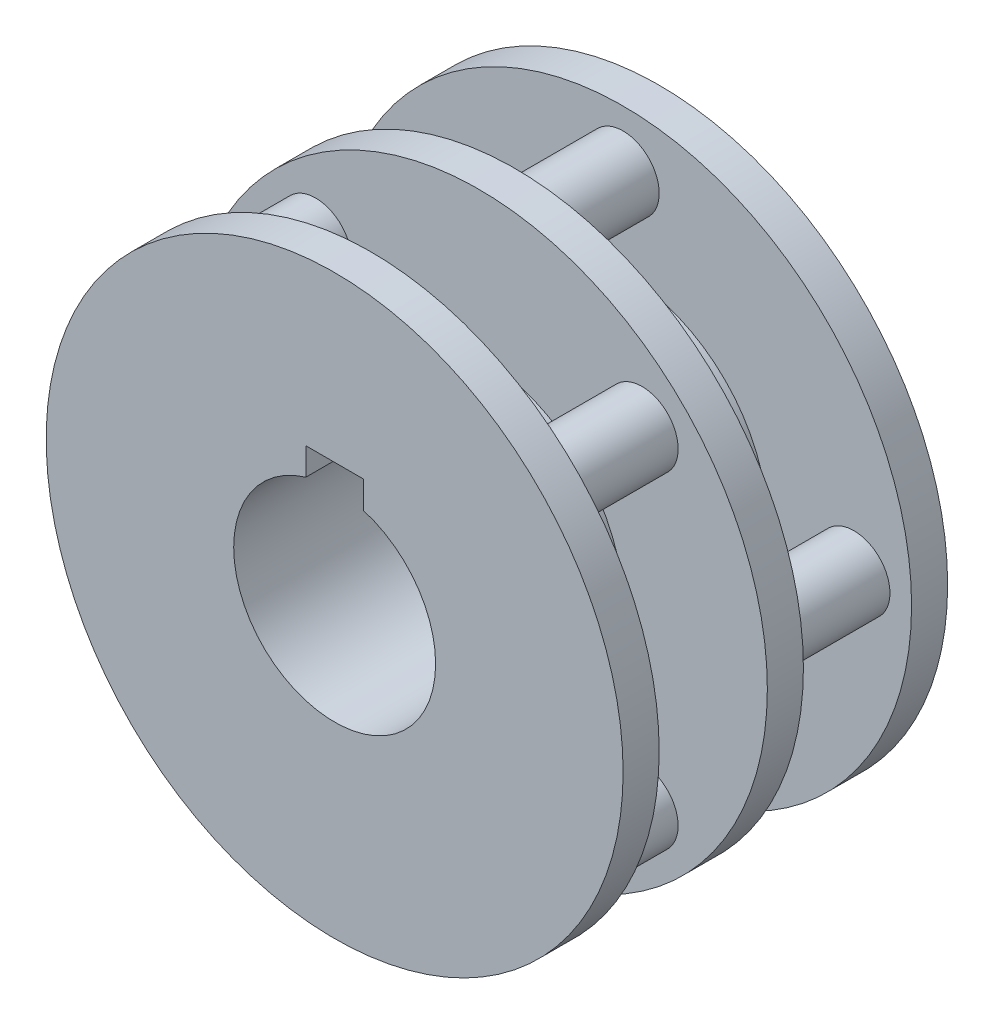
ISO-10303-21;
HEADER;
FILE_DESCRIPTION(('STEP AP214'),'2;1');
FILE_NAME('part.step','',(''),(''),'','','');
FILE_SCHEMA(('AUTOMOTIVE_DESIGN { 1 0 10303 214 1 1 1 1 }'));
ENDSEC;
DATA;
#1=APPLICATION_CONTEXT('core data for automotive mechanical design processes');
#2=APPLICATION_PROTOCOL_DEFINITION('international standard','automotive_design',2000,#1);
#3=PRODUCT_CONTEXT('',#1,'mechanical');
#4=PRODUCT('Part','Part','',(#3));
#5=PRODUCT_RELATED_PRODUCT_CATEGORY('part','',(#4));
#6=PRODUCT_DEFINITION_FORMATION('','',#4);
#7=PRODUCT_DEFINITION_CONTEXT('part definition',#1,'design');
#8=PRODUCT_DEFINITION('design','',#6,#7);
#9=PRODUCT_DEFINITION_SHAPE('','',#8);
#10=(LENGTH_UNIT() NAMED_UNIT(*) SI_UNIT(.MILLI.,.METRE.));
#11=(NAMED_UNIT(*) PLANE_ANGLE_UNIT() SI_UNIT($,.RADIAN.));
#12=(NAMED_UNIT(*) SI_UNIT($,.STERADIAN.) SOLID_ANGLE_UNIT());
#13=UNCERTAINTY_MEASURE_WITH_UNIT(LENGTH_MEASURE(1.E-05),#10,'distance_accuracy_value','');
#14=(GEOMETRIC_REPRESENTATION_CONTEXT(3) GLOBAL_UNCERTAINTY_ASSIGNED_CONTEXT((#13)) GLOBAL_UNIT_ASSIGNED_CONTEXT((#10,
#11,#12)) REPRESENTATION_CONTEXT('',''));
#15=CARTESIAN_POINT('',(0.,0.,0.));
#16=DIRECTION('',(0.,0.,1.));
#17=DIRECTION('',(1.,0.,0.));
#18=AXIS2_PLACEMENT_3D('',#15,#16,#17);
#19=CARTESIAN_POINT('',(0.,0.,25.));
#20=DIRECTION('',(0.,0.,1.));
#21=DIRECTION('',(1.,0.,0.));
#22=AXIS2_PLACEMENT_3D('',#19,#20,#21);
#23=PLANE('',#22);
#24=CARTESIAN_POINT('',(22.6274169979698,22.6274169979692,25.));
#25=DIRECTION('',(0.,0.,1.));
#26=DIRECTION('',(1.,0.,0.));
#27=AXIS2_PLACEMENT_3D('',#24,#25,#26);
#28=CIRCLE('',#27,5.);
#29=CARTESIAN_POINT('',(27.6274169979698,22.6274169979692,25.));
#30=VERTEX_POINT('',#29);
#31=EDGE_CURVE('E119',#30,#30,#28,.T.);
#32=ORIENTED_EDGE('',*,*,#31,.F.);
#33=EDGE_LOOP('',(#32));
#34=FACE_BOUND('',#33,.T.);
#35=CARTESIAN_POINT('',(-22.6274169979698,-22.6274169979692,25.));
#36=DIRECTION('',(0.,0.,1.));
#37=DIRECTION('',(1.,0.,0.));
#38=AXIS2_PLACEMENT_3D('',#35,#36,#37);
#39=CIRCLE('',#38,5.);
#40=CARTESIAN_POINT('',(-17.6274169979698,-22.6274169979692,25.));
#41=VERTEX_POINT('',#40);
#42=EDGE_CURVE('E131',#41,#41,#39,.T.);
#43=ORIENTED_EDGE('',*,*,#42,.F.);
#44=EDGE_LOOP('',(#43));
#45=FACE_BOUND('',#44,.T.);
#46=CARTESIAN_POINT('',(0.,0.,25.));
#47=DIRECTION('',(0.,0.,1.));
#48=DIRECTION('',(1.,0.,0.));
#49=AXIS2_PLACEMENT_3D('',#46,#47,#48);
#50=CIRCLE('',#49,40.);
#51=CARTESIAN_POINT('',(40.,0.,25.));
#52=VERTEX_POINT('',#51);
#53=EDGE_CURVE('E146',#52,#52,#50,.T.);
#54=ORIENTED_EDGE('',*,*,#53,.T.);
#55=EDGE_LOOP('',(#54));
#56=FACE_BOUND('',#55,.T.);
#57=CARTESIAN_POINT('',(22.6274169979692,-22.6274169979698,25.));
#58=DIRECTION('',(0.,0.,1.));
#59=DIRECTION('',(1.,0.,0.));
#60=AXIS2_PLACEMENT_3D('',#57,#58,#59);
#61=CIRCLE('',#60,5.);
#62=CARTESIAN_POINT('',(27.6274169979692,-22.6274169979698,25.));
#63=VERTEX_POINT('',#62);
#64=EDGE_CURVE('E137',#63,#63,#61,.T.);
#65=ORIENTED_EDGE('',*,*,#64,.F.);
#66=EDGE_LOOP('',(#65));
#67=FACE_BOUND('',#66,.T.);
#68=CARTESIAN_POINT('',(-22.6274169979692,22.6274169979698,25.));
#69=DIRECTION('',(0.,0.,1.));
#70=DIRECTION('',(1.,0.,0.));
#71=AXIS2_PLACEMENT_3D('',#68,#69,#70);
#72=CIRCLE('',#71,5.);
#73=CARTESIAN_POINT('',(-17.6274169979692,22.6274169979698,25.));
#74=VERTEX_POINT('',#73);
#75=EDGE_CURVE('E125',#74,#74,#72,.T.);
#76=ORIENTED_EDGE('',*,*,#75,.F.);
#77=EDGE_LOOP('',(#76));
#78=FACE_BOUND('',#77,.T.);
#79=CARTESIAN_POINT('',(0.,0.,25.));
#80=DIRECTION('',(0.,0.,1.));
#81=DIRECTION('',(1.,0.,0.));
#82=AXIS2_PLACEMENT_3D('',#79,#80,#81);
#83=CIRCLE('',#82,20.);
#84=CARTESIAN_POINT('',(20.,0.,25.));
#85=VERTEX_POINT('',#84);
#86=EDGE_CURVE('E108',#85,#85,#83,.F.);
#87=ORIENTED_EDGE('',*,*,#86,.T.);
#88=EDGE_LOOP('',(#87));
#89=FACE_BOUND('',#88,.T.);
#90=ADVANCED_FACE('F32',(#34,#45,#56,#67,#78,#89),#23,.T.);
#91=CARTESIAN_POINT('',(0.,0.,5.));
#92=DIRECTION('',(0.,0.,1.));
#93=DIRECTION('',(1.,0.,0.));
#94=AXIS2_PLACEMENT_3D('',#91,#92,#93);
#95=PLANE('',#94);
#96=CARTESIAN_POINT('',(0.,32.,5.));
#97=DIRECTION('',(0.,0.,1.));
#98=DIRECTION('',(1.,0.,0.));
#99=AXIS2_PLACEMENT_3D('',#96,#97,#98);
#100=CIRCLE('',#99,5.);
#101=CARTESIAN_POINT('',(5.,32.,5.));
#102=VERTEX_POINT('',#101);
#103=EDGE_CURVE('E149',#102,#102,#100,.T.);
#104=ORIENTED_EDGE('',*,*,#103,.F.);
#105=EDGE_LOOP('',(#104));
#106=FACE_BOUND('',#105,.T.);
#107=CARTESIAN_POINT('',(0.,-32.,5.));
#108=DIRECTION('',(0.,0.,1.));
#109=DIRECTION('',(1.,0.,0.));
#110=AXIS2_PLACEMENT_3D('',#107,#108,#109);
#111=CIRCLE('',#110,5.);
#112=CARTESIAN_POINT('',(5.,-32.,5.));
#113=VERTEX_POINT('',#112);
#114=EDGE_CURVE('E161',#113,#113,#111,.T.);
#115=ORIENTED_EDGE('',*,*,#114,.F.);
#116=EDGE_LOOP('',(#115));
#117=FACE_BOUND('',#116,.T.);
#118=CARTESIAN_POINT('',(0.,0.,5.));
#119=DIRECTION('',(0.,0.,1.));
#120=DIRECTION('',(1.,0.,0.));
#121=AXIS2_PLACEMENT_3D('',#118,#119,#120);
#122=CIRCLE('',#121,40.);
#123=CARTESIAN_POINT('',(40.,0.,5.));
#124=VERTEX_POINT('',#123);
#125=EDGE_CURVE('E176',#124,#124,#122,.T.);
#126=ORIENTED_EDGE('',*,*,#125,.T.);
#127=EDGE_LOOP('',(#126));
#128=FACE_BOUND('',#127,.T.);
#129=CARTESIAN_POINT('',(32.,0.,5.));
#130=DIRECTION('',(0.,0.,1.));
#131=DIRECTION('',(1.,0.,0.));
#132=AXIS2_PLACEMENT_3D('',#129,#130,#131);
#133=CIRCLE('',#132,5.);
#134=CARTESIAN_POINT('',(37.,0.,5.));
#135=VERTEX_POINT('',#134);
#136=EDGE_CURVE('E167',#135,#135,#133,.T.);
#137=ORIENTED_EDGE('',*,*,#136,.F.);
#138=EDGE_LOOP('',(#137));
#139=FACE_BOUND('',#138,.T.);
#140=CARTESIAN_POINT('',(-32.,0.,5.));
#141=DIRECTION('',(0.,0.,1.));
#142=DIRECTION('',(1.,0.,0.));
#143=AXIS2_PLACEMENT_3D('',#140,#141,#142);
#144=CIRCLE('',#143,5.);
#145=CARTESIAN_POINT('',(-27.,0.,5.));
#146=VERTEX_POINT('',#145);
#147=EDGE_CURVE('E155',#146,#146,#144,.T.);
#148=ORIENTED_EDGE('',*,*,#147,.F.);
#149=EDGE_LOOP('',(#148));
#150=FACE_BOUND('',#149,.T.);
#151=CARTESIAN_POINT('',(0.,0.,5.));
#152=DIRECTION('',(0.,0.,1.));
#153=DIRECTION('',(1.,0.,0.));
#154=AXIS2_PLACEMENT_3D('',#151,#152,#153);
#155=CIRCLE('',#154,20.);
#156=CARTESIAN_POINT('',(20.,0.,5.));
#157=VERTEX_POINT('',#156);
#158=EDGE_CURVE('E105',#157,#157,#155,.T.);
#159=ORIENTED_EDGE('',*,*,#158,.F.);
#160=EDGE_LOOP('',(#159));
#161=FACE_BOUND('',#160,.T.);
#162=ADVANCED_FACE('F198',(#106,#117,#128,#139,#150,#161),#95,.T.);
#163=CARTESIAN_POINT('',(0.,0.,20.));
#164=DIRECTION('',(0.,0.,1.));
#165=DIRECTION('',(1.,0.,0.));
#166=AXIS2_PLACEMENT_3D('',#163,#164,#165);
#167=PLANE('',#166);
#168=CARTESIAN_POINT('',(32.,0.,20.));
#169=DIRECTION('',(0.,0.,1.));
#170=DIRECTION('',(1.,0.,0.));
#171=AXIS2_PLACEMENT_3D('',#168,#169,#170);
#172=CIRCLE('',#171,5.);
#173=CARTESIAN_POINT('',(37.,0.,20.));
#174=VERTEX_POINT('',#173);
#175=EDGE_CURVE('E170',#174,#174,#172,.T.);
#176=ORIENTED_EDGE('',*,*,#175,.T.);
#177=EDGE_LOOP('',(#176));
#178=FACE_BOUND('',#177,.T.);
#179=CARTESIAN_POINT('',(-32.,0.,20.));
#180=DIRECTION('',(0.,0.,1.));
#181=DIRECTION('',(1.,0.,0.));
#182=AXIS2_PLACEMENT_3D('',#179,#180,#181);
#183=CIRCLE('',#182,5.);
#184=CARTESIAN_POINT('',(-27.,0.,20.));
#185=VERTEX_POINT('',#184);
#186=EDGE_CURVE('E158',#185,#185,#183,.T.);
#187=ORIENTED_EDGE('',*,*,#186,.T.);
#188=EDGE_LOOP('',(#187));
#189=FACE_BOUND('',#188,.T.);
#190=CARTESIAN_POINT('',(0.,0.,20.));
#191=DIRECTION('',(0.,0.,1.));
#192=DIRECTION('',(1.,0.,0.));
#193=AXIS2_PLACEMENT_3D('',#190,#191,#192);
#194=CIRCLE('',#193,40.);
#195=CARTESIAN_POINT('',(40.,0.,20.));
#196=VERTEX_POINT('',#195);
#197=EDGE_CURVE('E143',#196,#196,#194,.T.);
#198=ORIENTED_EDGE('',*,*,#197,.F.);
#199=EDGE_LOOP('',(#198));
#200=FACE_BOUND('',#199,.T.);
#201=CARTESIAN_POINT('',(0.,32.,20.));
#202=DIRECTION('',(0.,0.,1.));
#203=DIRECTION('',(1.,0.,0.));
#204=AXIS2_PLACEMENT_3D('',#201,#202,#203);
#205=CIRCLE('',#204,5.);
#206=CARTESIAN_POINT('',(5.,32.,20.));
#207=VERTEX_POINT('',#206);
#208=EDGE_CURVE('E152',#207,#207,#205,.T.);
#209=ORIENTED_EDGE('',*,*,#208,.T.);
#210=EDGE_LOOP('',(#209));
#211=FACE_BOUND('',#210,.T.);
#212=CARTESIAN_POINT('',(0.,-32.,20.));
#213=DIRECTION('',(0.,0.,1.));
#214=DIRECTION('',(1.,0.,0.));
#215=AXIS2_PLACEMENT_3D('',#212,#213,#214);
#216=CIRCLE('',#215,5.);
#217=CARTESIAN_POINT('',(5.,-32.,20.));
#218=VERTEX_POINT('',#217);
#219=EDGE_CURVE('E164',#218,#218,#216,.T.);
#220=ORIENTED_EDGE('',*,*,#219,.T.);
#221=EDGE_LOOP('',(#220));
#222=FACE_BOUND('',#221,.T.);
#223=CARTESIAN_POINT('',(0.,0.,20.));
#224=DIRECTION('',(0.,0.,1.));
#225=DIRECTION('',(1.,0.,0.));
#226=AXIS2_PLACEMENT_3D('',#223,#224,#225);
#227=CIRCLE('',#226,20.);
#228=CARTESIAN_POINT('',(20.,0.,20.));
#229=VERTEX_POINT('',#228);
#230=EDGE_CURVE('E109',#229,#229,#227,.F.);
#231=ORIENTED_EDGE('',*,*,#230,.F.);
#232=EDGE_LOOP('',(#231));
#233=FACE_BOUND('',#232,.T.);
#234=ADVANCED_FACE('F204',(#178,#189,#200,#211,#222,#233),#167,.F.);
#235=CARTESIAN_POINT('',(0.,0.,40.));
#236=DIRECTION('',(0.,0.,1.));
#237=DIRECTION('',(1.,0.,0.));
#238=AXIS2_PLACEMENT_3D('',#235,#236,#237);
#239=PLANE('',#238);
#240=CARTESIAN_POINT('',(22.6274169979692,-22.6274169979698,40.));
#241=DIRECTION('',(0.,0.,1.));
#242=DIRECTION('',(1.,0.,0.));
#243=AXIS2_PLACEMENT_3D('',#240,#241,#242);
#244=CIRCLE('',#243,5.);
#245=CARTESIAN_POINT('',(27.6274169979692,-22.6274169979698,40.));
#246=VERTEX_POINT('',#245);
#247=EDGE_CURVE('E140',#246,#246,#244,.T.);
#248=ORIENTED_EDGE('',*,*,#247,.T.);
#249=EDGE_LOOP('',(#248));
#250=FACE_BOUND('',#249,.T.);
#251=CARTESIAN_POINT('',(-22.6274169979692,22.6274169979698,40.));
#252=DIRECTION('',(0.,0.,1.));
#253=DIRECTION('',(1.,0.,0.));
#254=AXIS2_PLACEMENT_3D('',#251,#252,#253);
#255=CIRCLE('',#254,5.);
#256=CARTESIAN_POINT('',(-17.6274169979692,22.6274169979698,40.));
#257=VERTEX_POINT('',#256);
#258=EDGE_CURVE('E128',#257,#257,#255,.T.);
#259=ORIENTED_EDGE('',*,*,#258,.T.);
#260=EDGE_LOOP('',(#259));
#261=FACE_BOUND('',#260,.T.);
#262=CARTESIAN_POINT('',(0.,0.,40.));
#263=DIRECTION('',(0.,0.,1.));
#264=DIRECTION('',(1.,0.,0.));
#265=AXIS2_PLACEMENT_3D('',#262,#263,#264);
#266=CIRCLE('',#265,40.);
#267=CARTESIAN_POINT('',(40.,0.,40.));
#268=VERTEX_POINT('',#267);
#269=EDGE_CURVE('E115',#268,#268,#266,.T.);
#270=ORIENTED_EDGE('',*,*,#269,.F.);
#271=EDGE_LOOP('',(#270));
#272=FACE_BOUND('',#271,.T.);
#273=CARTESIAN_POINT('',(22.6274169979698,22.6274169979692,40.));
#274=DIRECTION('',(0.,0.,1.));
#275=DIRECTION('',(1.,0.,0.));
#276=AXIS2_PLACEMENT_3D('',#273,#274,#275);
#277=CIRCLE('',#276,5.);
#278=CARTESIAN_POINT('',(27.6274169979698,22.6274169979692,40.));
#279=VERTEX_POINT('',#278);
#280=EDGE_CURVE('E122',#279,#279,#277,.T.);
#281=ORIENTED_EDGE('',*,*,#280,.T.);
#282=EDGE_LOOP('',(#281));
#283=FACE_BOUND('',#282,.T.);
#284=CARTESIAN_POINT('',(-22.6274169979698,-22.6274169979692,40.));
#285=DIRECTION('',(0.,0.,1.));
#286=DIRECTION('',(1.,0.,0.));
#287=AXIS2_PLACEMENT_3D('',#284,#285,#286);
#288=CIRCLE('',#287,5.);
#289=CARTESIAN_POINT('',(-17.6274169979698,-22.6274169979692,40.));
#290=VERTEX_POINT('',#289);
#291=EDGE_CURVE('E134',#290,#290,#288,.T.);
#292=ORIENTED_EDGE('',*,*,#291,.T.);
#293=EDGE_LOOP('',(#292));
#294=FACE_BOUND('',#293,.T.);
#295=CARTESIAN_POINT('',(0.,0.,40.));
#296=DIRECTION('',(0.,0.,1.));
#297=DIRECTION('',(1.,0.,0.));
#298=AXIS2_PLACEMENT_3D('',#295,#296,#297);
#299=CIRCLE('',#298,20.);
#300=CARTESIAN_POINT('',(20.,0.,40.));
#301=VERTEX_POINT('',#300);
#302=EDGE_CURVE('E112',#301,#301,#299,.F.);
#303=ORIENTED_EDGE('',*,*,#302,.F.);
#304=EDGE_LOOP('',(#303));
#305=FACE_BOUND('',#304,.T.);
#306=ADVANCED_FACE('F215',(#250,#261,#272,#283,#294,#305),#239,.F.);
#307=CARTESIAN_POINT('',(0.,0.,5.));
#308=DIRECTION('',(0.,0.,-1.));
#309=DIRECTION('',(-1.,0.,0.));
#310=AXIS2_PLACEMENT_3D('',#307,#308,#309);
#311=CYLINDRICAL_SURFACE('',#310,40.);
#312=ORIENTED_EDGE('',*,*,#125,.F.);
#313=EDGE_LOOP('',(#312));
#314=FACE_BOUND('',#313,.T.);
#315=CARTESIAN_POINT('',(0.,0.,0.));
#316=DIRECTION('',(0.,0.,1.));
#317=DIRECTION('',(1.,0.,0.));
#318=AXIS2_PLACEMENT_3D('',#315,#316,#317);
#319=CIRCLE('',#318,40.);
#320=CARTESIAN_POINT('',(40.,0.,0.));
#321=VERTEX_POINT('',#320);
#322=EDGE_CURVE('E173',#321,#321,#319,.T.);
#323=ORIENTED_EDGE('',*,*,#322,.T.);
#324=EDGE_LOOP('',(#323));
#325=FACE_BOUND('',#324,.T.);
#326=ADVANCED_FACE('F34',(#314,#325),#311,.T.);
#327=CARTESIAN_POINT('',(0.,0.,0.));
#328=DIRECTION('',(0.,0.,1.));
#329=DIRECTION('',(1.,0.,0.));
#330=AXIS2_PLACEMENT_3D('',#327,#328,#329);
#331=PLANE('',#330);
#332=DIRECTION('',(-1.,0.,0.));
#333=VECTOR('',#332,1.);
#334=CARTESIAN_POINT('',(0.,17.2,0.));
#335=LINE('',#334,#333);
#336=CARTESIAN_POINT('',(4.,17.2,0.));
#337=VERTEX_POINT('',#336);
#338=CARTESIAN_POINT('',(-4.,17.2,0.));
#339=VERTEX_POINT('',#338);
#340=EDGE_CURVE('E79',#337,#339,#335,.T.);
#341=ORIENTED_EDGE('',*,*,#340,.T.);
#342=DIRECTION('',(0.,-1.,0.));
#343=VECTOR('',#342,1.);
#344=CARTESIAN_POINT('',(-4.,0.,0.));
#345=LINE('',#344,#343);
#346=CARTESIAN_POINT('',(-4.,13.4164078649987,0.));
#347=VERTEX_POINT('',#346);
#348=EDGE_CURVE('E97',#339,#347,#345,.T.);
#349=ORIENTED_EDGE('',*,*,#348,.T.);
#350=CARTESIAN_POINT('',(0.,0.,0.));
#351=DIRECTION('',(0.,0.,1.));
#352=DIRECTION('',(1.,0.,0.));
#353=AXIS2_PLACEMENT_3D('',#350,#351,#352);
#354=CIRCLE('',#353,14.);
#355=CARTESIAN_POINT('',(4.,13.4164078649987,0.));
#356=VERTEX_POINT('',#355);
#357=EDGE_CURVE('E102',#347,#356,#354,.T.);
#358=ORIENTED_EDGE('',*,*,#357,.T.);
#359=DIRECTION('',(0.,1.,0.));
#360=VECTOR('',#359,1.);
#361=CARTESIAN_POINT('',(4.,0.,0.));
#362=LINE('',#361,#360);
#363=EDGE_CURVE('E47',#356,#337,#362,.T.);
#364=ORIENTED_EDGE('',*,*,#363,.T.);
#365=EDGE_LOOP('',(#341,#349,#358,#364));
#366=FACE_BOUND('',#365,.T.);
#367=ORIENTED_EDGE('',*,*,#322,.F.);
#368=EDGE_LOOP('',(#367));
#369=FACE_BOUND('',#368,.T.);
#370=ADVANCED_FACE('F186',(#366,#369),#331,.F.);
#371=CARTESIAN_POINT('',(32.,0.,20.));
#372=DIRECTION('',(0.,0.,-1.));
#373=DIRECTION('',(-1.,0.,0.));
#374=AXIS2_PLACEMENT_3D('',#371,#372,#373);
#375=CYLINDRICAL_SURFACE('',#374,5.);
#376=ORIENTED_EDGE('',*,*,#175,.F.);
#377=EDGE_LOOP('',(#376));
#378=FACE_BOUND('',#377,.T.);
#379=ORIENTED_EDGE('',*,*,#136,.T.);
#380=EDGE_LOOP('',(#379));
#381=FACE_BOUND('',#380,.T.);
#382=ADVANCED_FACE('F232',(#378,#381),#375,.T.);
#383=CARTESIAN_POINT('',(0.,-32.,20.));
#384=DIRECTION('',(0.,0.,-1.));
#385=DIRECTION('',(-1.,0.,0.));
#386=AXIS2_PLACEMENT_3D('',#383,#384,#385);
#387=CYLINDRICAL_SURFACE('',#386,5.);
#388=ORIENTED_EDGE('',*,*,#219,.F.);
#389=EDGE_LOOP('',(#388));
#390=FACE_BOUND('',#389,.T.);
#391=ORIENTED_EDGE('',*,*,#114,.T.);
#392=EDGE_LOOP('',(#391));
#393=FACE_BOUND('',#392,.T.);
#394=ADVANCED_FACE('F228',(#390,#393),#387,.T.);
#395=CARTESIAN_POINT('',(-32.,0.,20.));
#396=DIRECTION('',(0.,0.,-1.));
#397=DIRECTION('',(-1.,0.,0.));
#398=AXIS2_PLACEMENT_3D('',#395,#396,#397);
#399=CYLINDRICAL_SURFACE('',#398,5.);
#400=ORIENTED_EDGE('',*,*,#186,.F.);
#401=EDGE_LOOP('',(#400));
#402=FACE_BOUND('',#401,.T.);
#403=ORIENTED_EDGE('',*,*,#147,.T.);
#404=EDGE_LOOP('',(#403));
#405=FACE_BOUND('',#404,.T.);
#406=ADVANCED_FACE('F224',(#402,#405),#399,.T.);
#407=CARTESIAN_POINT('',(0.,32.,20.));
#408=DIRECTION('',(0.,0.,-1.));
#409=DIRECTION('',(-1.,0.,0.));
#410=AXIS2_PLACEMENT_3D('',#407,#408,#409);
#411=CYLINDRICAL_SURFACE('',#410,5.);
#412=ORIENTED_EDGE('',*,*,#208,.F.);
#413=EDGE_LOOP('',(#412));
#414=FACE_BOUND('',#413,.T.);
#415=ORIENTED_EDGE('',*,*,#103,.T.);
#416=EDGE_LOOP('',(#415));
#417=FACE_BOUND('',#416,.T.);
#418=ADVANCED_FACE('F220',(#414,#417),#411,.T.);
#419=CARTESIAN_POINT('',(0.,0.,25.));
#420=DIRECTION('',(0.,0.,-1.));
#421=DIRECTION('',(-1.,0.,0.));
#422=AXIS2_PLACEMENT_3D('',#419,#420,#421);
#423=CYLINDRICAL_SURFACE('',#422,40.);
#424=ORIENTED_EDGE('',*,*,#53,.F.);
#425=EDGE_LOOP('',(#424));
#426=FACE_BOUND('',#425,.T.);
#427=ORIENTED_EDGE('',*,*,#197,.T.);
#428=EDGE_LOOP('',(#427));
#429=FACE_BOUND('',#428,.T.);
#430=ADVANCED_FACE('F217',(#426,#429),#423,.T.);
#431=CARTESIAN_POINT('',(22.6274169979692,-22.6274169979698,40.));
#432=DIRECTION('',(0.,0.,-1.));
#433=DIRECTION('',(-1.,0.,0.));
#434=AXIS2_PLACEMENT_3D('',#431,#432,#433);
#435=CYLINDRICAL_SURFACE('',#434,5.);
#436=ORIENTED_EDGE('',*,*,#247,.F.);
#437=EDGE_LOOP('',(#436));
#438=FACE_BOUND('',#437,.T.);
#439=ORIENTED_EDGE('',*,*,#64,.T.);
#440=EDGE_LOOP('',(#439));
#441=FACE_BOUND('',#440,.T.);
#442=ADVANCED_FACE('F211',(#438,#441),#435,.T.);
#443=CARTESIAN_POINT('',(-22.6274169979698,-22.6274169979692,40.));
#444=DIRECTION('',(0.,0.,-1.));
#445=DIRECTION('',(-1.,0.,0.));
#446=AXIS2_PLACEMENT_3D('',#443,#444,#445);
#447=CYLINDRICAL_SURFACE('',#446,5.);
#448=ORIENTED_EDGE('',*,*,#291,.F.);
#449=EDGE_LOOP('',(#448));
#450=FACE_BOUND('',#449,.T.);
#451=ORIENTED_EDGE('',*,*,#42,.T.);
#452=EDGE_LOOP('',(#451));
#453=FACE_BOUND('',#452,.T.);
#454=ADVANCED_FACE('F283',(#450,#453),#447,.T.);
#455=CARTESIAN_POINT('',(-22.6274169979692,22.6274169979698,40.));
#456=DIRECTION('',(0.,0.,-1.));
#457=DIRECTION('',(-1.,0.,0.));
#458=AXIS2_PLACEMENT_3D('',#455,#456,#457);
#459=CYLINDRICAL_SURFACE('',#458,5.);
#460=ORIENTED_EDGE('',*,*,#258,.F.);
#461=EDGE_LOOP('',(#460));
#462=FACE_BOUND('',#461,.T.);
#463=ORIENTED_EDGE('',*,*,#75,.T.);
#464=EDGE_LOOP('',(#463));
#465=FACE_BOUND('',#464,.T.);
#466=ADVANCED_FACE('F280',(#462,#465),#459,.T.);
#467=CARTESIAN_POINT('',(22.6274169979698,22.6274169979692,40.));
#468=DIRECTION('',(0.,0.,-1.));
#469=DIRECTION('',(-1.,0.,0.));
#470=AXIS2_PLACEMENT_3D('',#467,#468,#469);
#471=CYLINDRICAL_SURFACE('',#470,5.);
#472=ORIENTED_EDGE('',*,*,#280,.F.);
#473=EDGE_LOOP('',(#472));
#474=FACE_BOUND('',#473,.T.);
#475=ORIENTED_EDGE('',*,*,#31,.T.);
#476=EDGE_LOOP('',(#475));
#477=FACE_BOUND('',#476,.T.);
#478=ADVANCED_FACE('F276',(#474,#477),#471,.T.);
#479=CARTESIAN_POINT('',(0.,0.,45.));
#480=DIRECTION('',(0.,0.,-1.));
#481=DIRECTION('',(-1.,0.,0.));
#482=AXIS2_PLACEMENT_3D('',#479,#480,#481);
#483=CYLINDRICAL_SURFACE('',#482,40.);
#484=CARTESIAN_POINT('',(0.,0.,45.));
#485=DIRECTION('',(0.,0.,1.));
#486=DIRECTION('',(1.,0.,0.));
#487=AXIS2_PLACEMENT_3D('',#484,#485,#486);
#488=CIRCLE('',#487,40.);
#489=CARTESIAN_POINT('',(40.,0.,45.));
#490=VERTEX_POINT('',#489);
#491=EDGE_CURVE('E116',#490,#490,#488,.T.);
#492=ORIENTED_EDGE('',*,*,#491,.F.);
#493=EDGE_LOOP('',(#492));
#494=FACE_BOUND('',#493,.T.);
#495=ORIENTED_EDGE('',*,*,#269,.T.);
#496=EDGE_LOOP('',(#495));
#497=FACE_BOUND('',#496,.T.);
#498=ADVANCED_FACE('F272',(#494,#497),#483,.T.);
#499=CARTESIAN_POINT('',(0.,0.,45.));
#500=DIRECTION('',(0.,0.,1.));
#501=DIRECTION('',(1.,0.,0.));
#502=AXIS2_PLACEMENT_3D('',#499,#500,#501);
#503=PLANE('',#502);
#504=DIRECTION('',(0.,-1.,0.));
#505=VECTOR('',#504,1.);
#506=CARTESIAN_POINT('',(-4.,14.,45.));
#507=LINE('',#506,#505);
#508=CARTESIAN_POINT('',(-4.,17.2,45.));
#509=VERTEX_POINT('',#508);
#510=CARTESIAN_POINT('',(-4.,13.4164078649987,45.));
#511=VERTEX_POINT('',#510);
#512=EDGE_CURVE('E81',#509,#511,#507,.T.);
#513=ORIENTED_EDGE('',*,*,#512,.F.);
#514=DIRECTION('',(-1.,0.,0.));
#515=VECTOR('',#514,1.);
#516=CARTESIAN_POINT('',(4.,17.2,45.));
#517=LINE('',#516,#515);
#518=CARTESIAN_POINT('',(4.,17.2,45.));
#519=VERTEX_POINT('',#518);
#520=EDGE_CURVE('E76',#519,#509,#517,.T.);
#521=ORIENTED_EDGE('',*,*,#520,.F.);
#522=DIRECTION('',(0.,1.,0.));
#523=VECTOR('',#522,1.);
#524=CARTESIAN_POINT('',(4.,14.,45.));
#525=LINE('',#524,#523);
#526=CARTESIAN_POINT('',(4.,13.4164078649987,45.));
#527=VERTEX_POINT('',#526);
#528=EDGE_CURVE('E84',#527,#519,#525,.T.);
#529=ORIENTED_EDGE('',*,*,#528,.F.);
#530=CARTESIAN_POINT('',(0.,0.,45.));
#531=DIRECTION('',(0.,0.,1.));
#532=DIRECTION('',(1.,0.,0.));
#533=AXIS2_PLACEMENT_3D('',#530,#531,#532);
#534=CIRCLE('',#533,14.);
#535=EDGE_CURVE('E100',#511,#527,#534,.T.);
#536=ORIENTED_EDGE('',*,*,#535,.F.);
#537=EDGE_LOOP('',(#513,#521,#529,#536));
#538=FACE_BOUND('',#537,.T.);
#539=ORIENTED_EDGE('',*,*,#491,.T.);
#540=EDGE_LOOP('',(#539));
#541=FACE_BOUND('',#540,.T.);
#542=ADVANCED_FACE('F90',(#538,#541),#503,.T.);
#543=CARTESIAN_POINT('',(0.,0.,96.5685424949238));
#544=DIRECTION('',(0.,0.,-1.));
#545=DIRECTION('',(-1.,0.,0.));
#546=AXIS2_PLACEMENT_3D('',#543,#544,#545);
#547=CYLINDRICAL_SURFACE('',#546,20.);
#548=ORIENTED_EDGE('',*,*,#86,.F.);
#549=EDGE_LOOP('',(#548));
#550=FACE_BOUND('',#549,.T.);
#551=ORIENTED_EDGE('',*,*,#302,.T.);
#552=EDGE_LOOP('',(#551));
#553=FACE_BOUND('',#552,.T.);
#554=ADVANCED_FACE('F260',(#550,#553),#547,.T.);
#555=ORIENTED_EDGE('',*,*,#158,.T.);
#556=EDGE_LOOP('',(#555));
#557=FACE_BOUND('',#556,.T.);
#558=ORIENTED_EDGE('',*,*,#230,.T.);
#559=EDGE_LOOP('',(#558));
#560=FACE_BOUND('',#559,.T.);
#561=ADVANCED_FACE('F257',(#557,#560),#547,.T.);
#562=CARTESIAN_POINT('',(0.,0.,-12.));
#563=DIRECTION('',(0.,0.,1.));
#564=DIRECTION('',(1.,0.,0.));
#565=AXIS2_PLACEMENT_3D('',#562,#563,#564);
#566=CYLINDRICAL_SURFACE('',#565,14.);
#567=ORIENTED_EDGE('',*,*,#357,.F.);
#568=DIRECTION('',(0.,0.,1.));
#569=VECTOR('',#568,1.);
#570=CARTESIAN_POINT('',(-4.,13.4164078649987,-12.));
#571=LINE('',#570,#569);
#572=EDGE_CURVE('E11',#347,#511,#571,.T.);
#573=ORIENTED_EDGE('',*,*,#572,.T.);
#574=ORIENTED_EDGE('',*,*,#535,.T.);
#575=DIRECTION('',(0.,0.,1.));
#576=VECTOR('',#575,1.);
#577=CARTESIAN_POINT('',(4.,13.4164078649987,-12.));
#578=LINE('',#577,#576);
#579=EDGE_CURVE('E40',#527,#356,#578,.F.);
#580=ORIENTED_EDGE('',*,*,#579,.T.);
#581=EDGE_LOOP('',(#567,#573,#574,#580));
#582=FACE_BOUND('',#581,.T.);
#583=ADVANCED_FACE('F184',(#582),#566,.F.);
#584=CARTESIAN_POINT('',(4.,17.2,-12.));
#585=DIRECTION('',(0.,1.,0.));
#586=DIRECTION('',(0.,0.,1.));
#587=AXIS2_PLACEMENT_3D('',#584,#585,#586);
#588=PLANE('',#587);
#589=DIRECTION('',(0.,0.,1.));
#590=VECTOR('',#589,1.);
#591=CARTESIAN_POINT('',(4.,17.2,-12.));
#592=LINE('',#591,#590);
#593=EDGE_CURVE('E71',#337,#519,#592,.T.);
#594=ORIENTED_EDGE('',*,*,#593,.T.);
#595=ORIENTED_EDGE('',*,*,#520,.T.);
#596=DIRECTION('',(0.,0.,1.));
#597=VECTOR('',#596,1.);
#598=CARTESIAN_POINT('',(-4.,17.2,-12.));
#599=LINE('',#598,#597);
#600=EDGE_CURVE('E80',#339,#509,#599,.T.);
#601=ORIENTED_EDGE('',*,*,#600,.F.);
#602=ORIENTED_EDGE('',*,*,#340,.F.);
#603=EDGE_LOOP('',(#594,#595,#601,#602));
#604=FACE_BOUND('',#603,.T.);
#605=ADVANCED_FACE('F73',(#604),#588,.F.);
#606=CARTESIAN_POINT('',(-4.,14.,-12.));
#607=DIRECTION('',(-1.,0.,0.));
#608=DIRECTION('',(0.,0.,1.));
#609=AXIS2_PLACEMENT_3D('',#606,#607,#608);
#610=PLANE('',#609);
#611=ORIENTED_EDGE('',*,*,#600,.T.);
#612=ORIENTED_EDGE('',*,*,#512,.T.);
#613=ORIENTED_EDGE('',*,*,#572,.F.);
#614=ORIENTED_EDGE('',*,*,#348,.F.);
#615=EDGE_LOOP('',(#611,#612,#613,#614));
#616=FACE_BOUND('',#615,.T.);
#617=ADVANCED_FACE('F188',(#616),#610,.F.);
#618=CARTESIAN_POINT('',(4.,14.,-12.));
#619=DIRECTION('',(1.,0.,0.));
#620=DIRECTION('',(0.,0.,-1.));
#621=AXIS2_PLACEMENT_3D('',#618,#619,#620);
#622=PLANE('',#621);
#623=ORIENTED_EDGE('',*,*,#579,.F.);
#624=ORIENTED_EDGE('',*,*,#528,.T.);
#625=ORIENTED_EDGE('',*,*,#593,.F.);
#626=ORIENTED_EDGE('',*,*,#363,.F.);
#627=EDGE_LOOP('',(#623,#624,#625,#626));
#628=FACE_BOUND('',#627,.T.);
#629=ADVANCED_FACE('F85',(#628),#622,.F.);
#630=CLOSED_SHELL('',(#90,#162,#234,#306,#326,#370,#382,#394,#406,#418,#430,#442,#454,#466,#478,
#498,#542,#554,#561,#583,#605,#617,#629));
#631=MANIFOLD_SOLID_BREP('B2',#630);
#632=ADVANCED_BREP_SHAPE_REPRESENTATION('',(#18,#631),#14);
#633=SHAPE_DEFINITION_REPRESENTATION(#9,#632);
ENDSEC;
END-ISO-10303-21;
